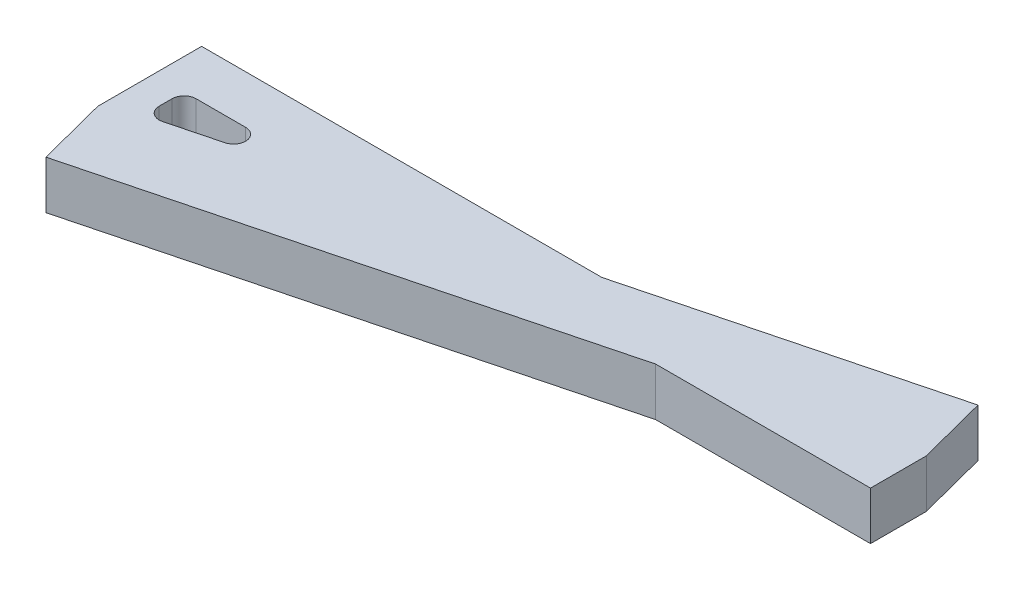
ISO-10303-21;
HEADER;
FILE_DESCRIPTION(('STEP AP214'),'2;1');
FILE_NAME('part.step','',(''),(''),'','','');
FILE_SCHEMA(('AUTOMOTIVE_DESIGN { 1 0 10303 214 1 1 1 1 }'));
ENDSEC;
DATA;
#1=APPLICATION_CONTEXT('core data for automotive mechanical design processes');
#2=APPLICATION_PROTOCOL_DEFINITION('international standard','automotive_design',2000,#1);
#3=PRODUCT_CONTEXT('',#1,'mechanical');
#4=PRODUCT('Part','Part','',(#3));
#5=PRODUCT_RELATED_PRODUCT_CATEGORY('part','',(#4));
#6=PRODUCT_DEFINITION_FORMATION('','',#4);
#7=PRODUCT_DEFINITION_CONTEXT('part definition',#1,'design');
#8=PRODUCT_DEFINITION('design','',#6,#7);
#9=PRODUCT_DEFINITION_SHAPE('','',#8);
#10=(LENGTH_UNIT() NAMED_UNIT(*) SI_UNIT(.MILLI.,.METRE.));
#11=(NAMED_UNIT(*) PLANE_ANGLE_UNIT() SI_UNIT($,.RADIAN.));
#12=(NAMED_UNIT(*) SI_UNIT($,.STERADIAN.) SOLID_ANGLE_UNIT());
#13=UNCERTAINTY_MEASURE_WITH_UNIT(LENGTH_MEASURE(1.E-05),#10,'distance_accuracy_value','');
#14=(GEOMETRIC_REPRESENTATION_CONTEXT(3) GLOBAL_UNCERTAINTY_ASSIGNED_CONTEXT((#13)) GLOBAL_UNIT_ASSIGNED_CONTEXT((#10,
#11,#12)) REPRESENTATION_CONTEXT('',''));
#15=CARTESIAN_POINT('',(0.,0.,0.));
#16=DIRECTION('',(0.,0.,1.));
#17=DIRECTION('',(1.,0.,0.));
#18=AXIS2_PLACEMENT_3D('',#15,#16,#17);
#19=CARTESIAN_POINT('',(0.,2.,0.));
#20=DIRECTION('',(0.,1.,0.));
#21=DIRECTION('',(0.,0.,1.));
#22=AXIS2_PLACEMENT_3D('',#19,#20,#21);
#23=PLANE('',#22);
#24=DIRECTION('',(0.251224776808077,0.,0.967928773989973));
#25=VECTOR('',#24,1.);
#26=CARTESIAN_POINT('',(-0.753674330424227,2.,-2.90378632196991));
#27=LINE('',#26,#25);
#28=CARTESIAN_POINT('',(-0.753674330424227,2.,-2.90378632196991));
#29=VERTEX_POINT('',#28);
#30=CARTESIAN_POINT('',(0.,2.,0.));
#31=VERTEX_POINT('',#30);
#32=EDGE_CURVE('E185',#29,#31,#27,.T.);
#33=ORIENTED_EDGE('',*,*,#32,.T.);
#34=DIRECTION('',(0.967928773989973,0.,-0.251224776808076));
#35=VECTOR('',#34,1.);
#36=CARTESIAN_POINT('',(0.,2.,0.));
#37=LINE('',#36,#35);
#38=CARTESIAN_POINT('',(20.112843106685,2.,-5.22026481310611));
#39=VERTEX_POINT('',#38);
#40=EDGE_CURVE('E188',#31,#39,#37,.T.);
#41=ORIENTED_EDGE('',*,*,#40,.T.);
#42=DIRECTION('',(1.,0.,0.));
#43=VECTOR('',#42,1.);
#44=CARTESIAN_POINT('',(20.112843106685,2.,-5.22026481310611));
#45=LINE('',#44,#43);
#46=CARTESIAN_POINT('',(29.0378632196992,2.,-5.2202648131061));
#47=VERTEX_POINT('',#46);
#48=EDGE_CURVE('E191',#39,#47,#45,.T.);
#49=ORIENTED_EDGE('',*,*,#48,.T.);
#50=DIRECTION('',(0.,0.,-1.));
#51=VECTOR('',#50,1.);
#52=CARTESIAN_POINT('',(29.0378632196992,2.,-7.2202648131061));
#53=LINE('',#52,#51);
#54=CARTESIAN_POINT('',(29.0378632196992,2.,-7.53674330424228));
#55=VERTEX_POINT('',#54);
#56=EDGE_CURVE('E193',#47,#55,#53,.T.);
#57=ORIENTED_EDGE('',*,*,#56,.T.);
#58=DIRECTION('',(-0.251224776808075,0.,-0.967928773989973));
#59=VECTOR('',#58,1.);
#60=CARTESIAN_POINT('',(29.0378632196992,2.,-7.53674330424228));
#61=LINE('',#60,#59);
#62=CARTESIAN_POINT('',(28.284188889275,2.,-10.4405296262122));
#63=VERTEX_POINT('',#62);
#64=EDGE_CURVE('E195',#55,#63,#61,.T.);
#65=ORIENTED_EDGE('',*,*,#64,.T.);
#66=DIRECTION('',(-0.967928773989973,0.,0.251224776808076));
#67=VECTOR('',#66,1.);
#68=CARTESIAN_POINT('',(28.284188889275,2.,-10.4405296262122));
#69=LINE('',#68,#67);
#70=CARTESIAN_POINT('',(15.8770250256005,2.,-7.2202648131061));
#71=VERTEX_POINT('',#70);
#72=EDGE_CURVE('E197',#63,#71,#69,.T.);
#73=ORIENTED_EDGE('',*,*,#72,.T.);
#74=DIRECTION('',(-1.,0.,0.));
#75=VECTOR('',#74,1.);
#76=CARTESIAN_POINT('',(-0.753674330424227,2.,-7.2202648131061));
#77=LINE('',#76,#75);
#78=CARTESIAN_POINT('',(-0.753674330424227,2.,-7.2202648131061));
#79=VERTEX_POINT('',#78);
#80=EDGE_CURVE('E199',#71,#79,#77,.T.);
#81=ORIENTED_EDGE('',*,*,#80,.T.);
#82=DIRECTION('',(0.,0.,1.));
#83=VECTOR('',#82,1.);
#84=CARTESIAN_POINT('',(-0.753674330424227,2.,-5.2202648131061));
#85=LINE('',#84,#83);
#86=EDGE_CURVE('E201',#79,#29,#85,.T.);
#87=ORIENTED_EDGE('',*,*,#86,.T.);
#88=EDGE_LOOP('',(#33,#41,#49,#57,#65,#73,#81,#87));
#89=FACE_BOUND('',#88,.T.);
#90=DIRECTION('',(-1.,0.,0.));
#91=VECTOR('',#90,1.);
#92=CARTESIAN_POINT('',(3.07440289689229,2.,-5.2202648131061));
#93=LINE('',#92,#91);
#94=CARTESIAN_POINT('',(3.07440289689229,2.,-5.2202648131061));
#95=VERTEX_POINT('',#94);
#96=CARTESIAN_POINT('',(1.01692955912154,2.,-5.2202648131061));
#97=VERTEX_POINT('',#96);
#98=EDGE_CURVE('E142',#95,#97,#93,.T.);
#99=ORIENTED_EDGE('',*,*,#98,.F.);
#100=CARTESIAN_POINT('',(3.0744028968924,2.,-4.7202648131061));
#101=DIRECTION('',(0.,1.,0.));
#102=DIRECTION('',(0.,0.,1.));
#103=AXIS2_PLACEMENT_3D('',#100,#101,#102);
#104=CIRCLE('',#103,0.5);
#105=CARTESIAN_POINT('',(3.20001528529633,2.,-4.23630042611108));
#106=VERTEX_POINT('',#105);
#107=EDGE_CURVE('E134',#106,#95,#104,.T.);
#108=ORIENTED_EDGE('',*,*,#107,.F.);
#109=DIRECTION('',(0.967928773989973,0.,-0.251224776808076));
#110=VECTOR('',#109,1.);
#111=CARTESIAN_POINT('',(1.14254194752558,2.,-3.70228563704833));
#112=LINE('',#111,#110);
#113=CARTESIAN_POINT('',(1.14254194752558,2.,-3.70228563704833));
#114=VERTEX_POINT('',#113);
#115=EDGE_CURVE('E163',#114,#106,#112,.T.);
#116=ORIENTED_EDGE('',*,*,#115,.F.);
#117=CARTESIAN_POINT('',(1.01692955912153,2.,-4.18625002404331));
#118=DIRECTION('',(0.,1.,0.));
#119=DIRECTION('',(0.,0.,-1.));
#120=AXIS2_PLACEMENT_3D('',#117,#118,#119);
#121=CIRCLE('',#120,0.5);
#122=CARTESIAN_POINT('',(0.516929559121535,2.,-4.18625002404332));
#123=VERTEX_POINT('',#122);
#124=EDGE_CURVE('E161',#123,#114,#121,.T.);
#125=ORIENTED_EDGE('',*,*,#124,.F.);
#126=DIRECTION('',(0.,0.,1.));
#127=VECTOR('',#126,1.);
#128=CARTESIAN_POINT('',(0.516929559121535,2.,-4.72026481310609));
#129=LINE('',#128,#127);
#130=CARTESIAN_POINT('',(0.516929559121535,2.,-4.72026481310609));
#131=VERTEX_POINT('',#130);
#132=EDGE_CURVE('E157',#131,#123,#129,.T.);
#133=ORIENTED_EDGE('',*,*,#132,.F.);
#134=CARTESIAN_POINT('',(1.01692955912153,2.,-4.7202648131061));
#135=DIRECTION('',(0.,1.,0.));
#136=DIRECTION('',(0.,0.,1.));
#137=AXIS2_PLACEMENT_3D('',#134,#135,#136);
#138=CIRCLE('',#137,0.5);
#139=EDGE_CURVE('E155',#97,#131,#138,.T.);
#140=ORIENTED_EDGE('',*,*,#139,.F.);
#141=EDGE_LOOP('',(#99,#108,#116,#125,#133,#140));
#142=FACE_BOUND('',#141,.T.);
#143=ADVANCED_FACE('F33',(#89,#142),#23,.T.);
#144=CARTESIAN_POINT('',(0.,0.,0.));
#145=DIRECTION('',(0.,1.,0.));
#146=DIRECTION('',(0.,0.,1.));
#147=AXIS2_PLACEMENT_3D('',#144,#145,#146);
#148=PLANE('',#147);
#149=DIRECTION('',(0.251224776808077,0.,0.967928773989973));
#150=VECTOR('',#149,1.);
#151=CARTESIAN_POINT('',(-0.753674330424227,0.,-2.90378632196991));
#152=LINE('',#151,#150);
#153=CARTESIAN_POINT('',(-0.753674330424227,0.,-2.90378632196991));
#154=VERTEX_POINT('',#153);
#155=CARTESIAN_POINT('',(0.,0.,0.));
#156=VERTEX_POINT('',#155);
#157=EDGE_CURVE('E150',#154,#156,#152,.T.);
#158=ORIENTED_EDGE('',*,*,#157,.F.);
#159=DIRECTION('',(0.,0.,1.));
#160=VECTOR('',#159,1.);
#161=CARTESIAN_POINT('',(-0.753674330424227,0.,-5.2202648131061));
#162=LINE('',#161,#160);
#163=CARTESIAN_POINT('',(-0.753674330424227,0.,-7.2202648131061));
#164=VERTEX_POINT('',#163);
#165=EDGE_CURVE('E189',#164,#154,#162,.T.);
#166=ORIENTED_EDGE('',*,*,#165,.F.);
#167=DIRECTION('',(-1.,0.,0.));
#168=VECTOR('',#167,1.);
#169=CARTESIAN_POINT('',(-0.753674330424227,0.,-7.2202648131061));
#170=LINE('',#169,#168);
#171=CARTESIAN_POINT('',(15.8770250256005,0.,-7.2202648131061));
#172=VERTEX_POINT('',#171);
#173=EDGE_CURVE('E217',#172,#164,#170,.T.);
#174=ORIENTED_EDGE('',*,*,#173,.F.);
#175=DIRECTION('',(-0.967928773989973,0.,0.251224776808076));
#176=VECTOR('',#175,1.);
#177=CARTESIAN_POINT('',(28.284188889275,0.,-10.4405296262122));
#178=LINE('',#177,#176);
#179=CARTESIAN_POINT('',(28.284188889275,0.,-10.4405296262122));
#180=VERTEX_POINT('',#179);
#181=EDGE_CURVE('E215',#180,#172,#178,.T.);
#182=ORIENTED_EDGE('',*,*,#181,.F.);
#183=DIRECTION('',(-0.251224776808075,0.,-0.967928773989973));
#184=VECTOR('',#183,1.);
#185=CARTESIAN_POINT('',(29.0378632196992,0.,-7.53674330424228));
#186=LINE('',#185,#184);
#187=CARTESIAN_POINT('',(29.0378632196992,0.,-7.53674330424228));
#188=VERTEX_POINT('',#187);
#189=EDGE_CURVE('E213',#188,#180,#186,.T.);
#190=ORIENTED_EDGE('',*,*,#189,.F.);
#191=DIRECTION('',(0.,0.,-1.));
#192=VECTOR('',#191,1.);
#193=CARTESIAN_POINT('',(29.0378632196992,0.,-7.2202648131061));
#194=LINE('',#193,#192);
#195=CARTESIAN_POINT('',(29.0378632196992,0.,-5.2202648131061));
#196=VERTEX_POINT('',#195);
#197=EDGE_CURVE('E211',#196,#188,#194,.T.);
#198=ORIENTED_EDGE('',*,*,#197,.F.);
#199=DIRECTION('',(1.,0.,0.));
#200=VECTOR('',#199,1.);
#201=CARTESIAN_POINT('',(20.112843106685,0.,-5.22026481310611));
#202=LINE('',#201,#200);
#203=CARTESIAN_POINT('',(20.112843106685,0.,-5.22026481310611));
#204=VERTEX_POINT('',#203);
#205=EDGE_CURVE('E208',#204,#196,#202,.T.);
#206=ORIENTED_EDGE('',*,*,#205,.F.);
#207=DIRECTION('',(0.967928773989973,0.,-0.251224776808076));
#208=VECTOR('',#207,1.);
#209=CARTESIAN_POINT('',(0.,0.,0.));
#210=LINE('',#209,#208);
#211=EDGE_CURVE('E206',#156,#204,#210,.T.);
#212=ORIENTED_EDGE('',*,*,#211,.F.);
#213=EDGE_LOOP('',(#158,#166,#174,#182,#190,#198,#206,#212));
#214=FACE_BOUND('',#213,.T.);
#215=CARTESIAN_POINT('',(3.0744028968924,0.,-4.7202648131061));
#216=DIRECTION('',(0.,1.,0.));
#217=DIRECTION('',(0.,0.,1.));
#218=AXIS2_PLACEMENT_3D('',#215,#216,#217);
#219=CIRCLE('',#218,0.5);
#220=CARTESIAN_POINT('',(3.20001528529633,0.,-4.23630042611108));
#221=VERTEX_POINT('',#220);
#222=CARTESIAN_POINT('',(3.07440289689229,0.,-5.2202648131061));
#223=VERTEX_POINT('',#222);
#224=EDGE_CURVE('E56',#221,#223,#219,.T.);
#225=ORIENTED_EDGE('',*,*,#224,.T.);
#226=DIRECTION('',(-1.,0.,0.));
#227=VECTOR('',#226,1.);
#228=CARTESIAN_POINT('',(3.07440289689229,0.,-5.2202648131061));
#229=LINE('',#228,#227);
#230=CARTESIAN_POINT('',(1.01692955912154,0.,-5.2202648131061));
#231=VERTEX_POINT('',#230);
#232=EDGE_CURVE('E149',#223,#231,#229,.T.);
#233=ORIENTED_EDGE('',*,*,#232,.T.);
#234=CARTESIAN_POINT('',(1.01692955912153,0.,-4.7202648131061));
#235=DIRECTION('',(0.,1.,0.));
#236=DIRECTION('',(0.,0.,1.));
#237=AXIS2_PLACEMENT_3D('',#234,#235,#236);
#238=CIRCLE('',#237,0.5);
#239=CARTESIAN_POINT('',(0.516929559121535,0.,-4.72026481310609));
#240=VERTEX_POINT('',#239);
#241=EDGE_CURVE('E167',#231,#240,#238,.T.);
#242=ORIENTED_EDGE('',*,*,#241,.T.);
#243=DIRECTION('',(0.,0.,1.));
#244=VECTOR('',#243,1.);
#245=CARTESIAN_POINT('',(0.516929559121535,0.,-4.72026481310609));
#246=LINE('',#245,#244);
#247=CARTESIAN_POINT('',(0.516929559121535,0.,-4.18625002404332));
#248=VERTEX_POINT('',#247);
#249=EDGE_CURVE('E170',#240,#248,#246,.T.);
#250=ORIENTED_EDGE('',*,*,#249,.T.);
#251=CARTESIAN_POINT('',(1.01692955912153,0.,-4.18625002404331));
#252=DIRECTION('',(0.,1.,0.));
#253=DIRECTION('',(0.,0.,-1.));
#254=AXIS2_PLACEMENT_3D('',#251,#252,#253);
#255=CIRCLE('',#254,0.5);
#256=CARTESIAN_POINT('',(1.14254194752558,0.,-3.70228563704833));
#257=VERTEX_POINT('',#256);
#258=EDGE_CURVE('E173',#248,#257,#255,.T.);
#259=ORIENTED_EDGE('',*,*,#258,.T.);
#260=DIRECTION('',(0.967928773989973,0.,-0.251224776808076));
#261=VECTOR('',#260,1.);
#262=CARTESIAN_POINT('',(1.14254194752558,0.,-3.70228563704833));
#263=LINE('',#262,#261);
#264=EDGE_CURVE('E143',#257,#221,#263,.T.);
#265=ORIENTED_EDGE('',*,*,#264,.T.);
#266=EDGE_LOOP('',(#225,#233,#242,#250,#259,#265));
#267=FACE_BOUND('',#266,.T.);
#268=ADVANCED_FACE('F247',(#214,#267),#148,.F.);
#269=CARTESIAN_POINT('',(-0.753674330424227,2.,-2.90378632196991));
#270=DIRECTION('',(0.967928773989973,0.,-0.251224776808077));
#271=DIRECTION('',(-0.251224776808076,0.,-0.967928773989973));
#272=AXIS2_PLACEMENT_3D('',#269,#270,#271);
#273=PLANE('',#272);
#274=ORIENTED_EDGE('',*,*,#157,.T.);
#275=DIRECTION('',(0.,-1.,0.));
#276=VECTOR('',#275,1.);
#277=CARTESIAN_POINT('',(0.,2.,0.));
#278=LINE('',#277,#276);
#279=EDGE_CURVE('E11',#31,#156,#278,.T.);
#280=ORIENTED_EDGE('',*,*,#279,.F.);
#281=ORIENTED_EDGE('',*,*,#32,.F.);
#282=DIRECTION('',(0.,-1.,0.));
#283=VECTOR('',#282,1.);
#284=CARTESIAN_POINT('',(-0.753674330424227,2.,-2.90378632196991));
#285=LINE('',#284,#283);
#286=EDGE_CURVE('E203',#29,#154,#285,.T.);
#287=ORIENTED_EDGE('',*,*,#286,.T.);
#288=EDGE_LOOP('',(#274,#280,#281,#287));
#289=FACE_BOUND('',#288,.T.);
#290=ADVANCED_FACE('F35',(#289),#273,.F.);
#291=CARTESIAN_POINT('',(0.,2.,0.));
#292=DIRECTION('',(-0.251224776808076,0.,-0.967928773989973));
#293=DIRECTION('',(-0.967928773989973,0.,0.251224776808076));
#294=AXIS2_PLACEMENT_3D('',#291,#292,#293);
#295=PLANE('',#294);
#296=ORIENTED_EDGE('',*,*,#211,.T.);
#297=DIRECTION('',(0.,-1.,0.));
#298=VECTOR('',#297,1.);
#299=CARTESIAN_POINT('',(20.112843106685,2.,-5.22026481310611));
#300=LINE('',#299,#298);
#301=EDGE_CURVE('E41',#39,#204,#300,.T.);
#302=ORIENTED_EDGE('',*,*,#301,.F.);
#303=ORIENTED_EDGE('',*,*,#40,.F.);
#304=ORIENTED_EDGE('',*,*,#279,.T.);
#305=EDGE_LOOP('',(#296,#302,#303,#304));
#306=FACE_BOUND('',#305,.T.);
#307=ADVANCED_FACE('F264',(#306),#295,.F.);
#308=CARTESIAN_POINT('',(20.112843106685,2.,-5.22026481310611));
#309=DIRECTION('',(0.,0.,-1.));
#310=DIRECTION('',(-1.,0.,0.));
#311=AXIS2_PLACEMENT_3D('',#308,#309,#310);
#312=PLANE('',#311);
#313=ORIENTED_EDGE('',*,*,#205,.T.);
#314=DIRECTION('',(0.,-1.,0.));
#315=VECTOR('',#314,1.);
#316=CARTESIAN_POINT('',(29.0378632196992,2.,-5.2202648131061));
#317=LINE('',#316,#315);
#318=EDGE_CURVE('E235',#47,#196,#317,.T.);
#319=ORIENTED_EDGE('',*,*,#318,.F.);
#320=ORIENTED_EDGE('',*,*,#48,.F.);
#321=ORIENTED_EDGE('',*,*,#301,.T.);
#322=EDGE_LOOP('',(#313,#319,#320,#321));
#323=FACE_BOUND('',#322,.T.);
#324=ADVANCED_FACE('F242',(#323),#312,.F.);
#325=CARTESIAN_POINT('',(29.0378632196992,2.,-7.2202648131061));
#326=DIRECTION('',(-1.,0.,0.));
#327=DIRECTION('',(0.,0.,1.));
#328=AXIS2_PLACEMENT_3D('',#325,#326,#327);
#329=PLANE('',#328);
#330=ORIENTED_EDGE('',*,*,#197,.T.);
#331=DIRECTION('',(0.,-1.,0.));
#332=VECTOR('',#331,1.);
#333=CARTESIAN_POINT('',(29.0378632196992,2.,-7.53674330424228));
#334=LINE('',#333,#332);
#335=EDGE_CURVE('E232',#55,#188,#334,.T.);
#336=ORIENTED_EDGE('',*,*,#335,.F.);
#337=ORIENTED_EDGE('',*,*,#56,.F.);
#338=ORIENTED_EDGE('',*,*,#318,.T.);
#339=EDGE_LOOP('',(#330,#336,#337,#338));
#340=FACE_BOUND('',#339,.T.);
#341=ADVANCED_FACE('F253',(#340),#329,.F.);
#342=CARTESIAN_POINT('',(29.0378632196992,2.,-7.53674330424228));
#343=DIRECTION('',(-0.967928773989973,0.,0.251224776808075));
#344=DIRECTION('',(0.251224776808075,0.,0.967928773989973));
#345=AXIS2_PLACEMENT_3D('',#342,#343,#344);
#346=PLANE('',#345);
#347=ORIENTED_EDGE('',*,*,#189,.T.);
#348=DIRECTION('',(0.,-1.,0.));
#349=VECTOR('',#348,1.);
#350=CARTESIAN_POINT('',(28.284188889275,2.,-10.4405296262122));
#351=LINE('',#350,#349);
#352=EDGE_CURVE('E229',#63,#180,#351,.T.);
#353=ORIENTED_EDGE('',*,*,#352,.F.);
#354=ORIENTED_EDGE('',*,*,#64,.F.);
#355=ORIENTED_EDGE('',*,*,#335,.T.);
#356=EDGE_LOOP('',(#347,#353,#354,#355));
#357=FACE_BOUND('',#356,.T.);
#358=ADVANCED_FACE('F257',(#357),#346,.F.);
#359=CARTESIAN_POINT('',(28.284188889275,2.,-10.4405296262122));
#360=DIRECTION('',(0.251224776808076,0.,0.967928773989973));
#361=DIRECTION('',(0.967928773989973,0.,-0.251224776808076));
#362=AXIS2_PLACEMENT_3D('',#359,#360,#361);
#363=PLANE('',#362);
#364=ORIENTED_EDGE('',*,*,#181,.T.);
#365=DIRECTION('',(0.,-1.,0.));
#366=VECTOR('',#365,1.);
#367=CARTESIAN_POINT('',(15.8770250256005,2.,-7.2202648131061));
#368=LINE('',#367,#366);
#369=EDGE_CURVE('E226',#71,#172,#368,.T.);
#370=ORIENTED_EDGE('',*,*,#369,.F.);
#371=ORIENTED_EDGE('',*,*,#72,.F.);
#372=ORIENTED_EDGE('',*,*,#352,.T.);
#373=EDGE_LOOP('',(#364,#370,#371,#372));
#374=FACE_BOUND('',#373,.T.);
#375=ADVANCED_FACE('F282',(#374),#363,.F.);
#376=CARTESIAN_POINT('',(-0.753674330424227,2.,-7.2202648131061));
#377=DIRECTION('',(0.,0.,1.));
#378=DIRECTION('',(1.,0.,0.));
#379=AXIS2_PLACEMENT_3D('',#376,#377,#378);
#380=PLANE('',#379);
#381=ORIENTED_EDGE('',*,*,#173,.T.);
#382=DIRECTION('',(0.,-1.,0.));
#383=VECTOR('',#382,1.);
#384=CARTESIAN_POINT('',(-0.753674330424227,2.,-7.2202648131061));
#385=LINE('',#384,#383);
#386=EDGE_CURVE('E223',#79,#164,#385,.T.);
#387=ORIENTED_EDGE('',*,*,#386,.F.);
#388=ORIENTED_EDGE('',*,*,#80,.F.);
#389=ORIENTED_EDGE('',*,*,#369,.T.);
#390=EDGE_LOOP('',(#381,#387,#388,#389));
#391=FACE_BOUND('',#390,.T.);
#392=ADVANCED_FACE('F271',(#391),#380,.F.);
#393=CARTESIAN_POINT('',(-0.753674330424227,2.,-5.2202648131061));
#394=DIRECTION('',(1.,0.,0.));
#395=DIRECTION('',(0.,0.,-1.));
#396=AXIS2_PLACEMENT_3D('',#393,#394,#395);
#397=PLANE('',#396);
#398=ORIENTED_EDGE('',*,*,#165,.T.);
#399=ORIENTED_EDGE('',*,*,#286,.F.);
#400=ORIENTED_EDGE('',*,*,#86,.F.);
#401=ORIENTED_EDGE('',*,*,#386,.T.);
#402=EDGE_LOOP('',(#398,#399,#400,#401));
#403=FACE_BOUND('',#402,.T.);
#404=ADVANCED_FACE('F274',(#403),#397,.F.);
#405=CARTESIAN_POINT('',(3.0744028968924,2.,-4.7202648131061));
#406=DIRECTION('',(0.,-1.,0.));
#407=DIRECTION('',(0.,0.,-1.));
#408=AXIS2_PLACEMENT_3D('',#405,#406,#407);
#409=CYLINDRICAL_SURFACE('',#408,0.5);
#410=ORIENTED_EDGE('',*,*,#224,.F.);
#411=DIRECTION('',(0.,-1.,0.));
#412=VECTOR('',#411,1.);
#413=CARTESIAN_POINT('',(3.20001528529633,2.,-4.23630042611108));
#414=LINE('',#413,#412);
#415=EDGE_CURVE('E138',#106,#221,#414,.T.);
#416=ORIENTED_EDGE('',*,*,#415,.F.);
#417=ORIENTED_EDGE('',*,*,#107,.T.);
#418=DIRECTION('',(0.,-1.,0.));
#419=VECTOR('',#418,1.);
#420=CARTESIAN_POINT('',(3.07440289689229,2.,-5.2202648131061));
#421=LINE('',#420,#419);
#422=EDGE_CURVE('E137',#95,#223,#421,.T.);
#423=ORIENTED_EDGE('',*,*,#422,.T.);
#424=EDGE_LOOP('',(#410,#416,#417,#423));
#425=FACE_BOUND('',#424,.T.);
#426=ADVANCED_FACE('F136',(#425),#409,.F.);
#427=CARTESIAN_POINT('',(3.07440289689229,2.,-5.2202648131061));
#428=DIRECTION('',(0.,0.,1.));
#429=DIRECTION('',(1.,0.,0.));
#430=AXIS2_PLACEMENT_3D('',#427,#428,#429);
#431=PLANE('',#430);
#432=ORIENTED_EDGE('',*,*,#232,.F.);
#433=ORIENTED_EDGE('',*,*,#422,.F.);
#434=ORIENTED_EDGE('',*,*,#98,.T.);
#435=DIRECTION('',(0.,-1.,0.));
#436=VECTOR('',#435,1.);
#437=CARTESIAN_POINT('',(1.01692955912154,2.,-5.2202648131061));
#438=LINE('',#437,#436);
#439=EDGE_CURVE('E151',#97,#231,#438,.T.);
#440=ORIENTED_EDGE('',*,*,#439,.T.);
#441=EDGE_LOOP('',(#432,#433,#434,#440));
#442=FACE_BOUND('',#441,.T.);
#443=ADVANCED_FACE('F146',(#442),#431,.T.);
#444=CARTESIAN_POINT('',(1.01692955912153,2.,-4.7202648131061));
#445=DIRECTION('',(0.,-1.,0.));
#446=DIRECTION('',(0.,0.,-1.));
#447=AXIS2_PLACEMENT_3D('',#444,#445,#446);
#448=CYLINDRICAL_SURFACE('',#447,0.5);
#449=ORIENTED_EDGE('',*,*,#241,.F.);
#450=ORIENTED_EDGE('',*,*,#439,.F.);
#451=ORIENTED_EDGE('',*,*,#139,.T.);
#452=DIRECTION('',(0.,-1.,0.));
#453=VECTOR('',#452,1.);
#454=CARTESIAN_POINT('',(0.516929559121535,2.,-4.72026481310609));
#455=LINE('',#454,#453);
#456=EDGE_CURVE('E182',#131,#240,#455,.T.);
#457=ORIENTED_EDGE('',*,*,#456,.T.);
#458=EDGE_LOOP('',(#449,#450,#451,#457));
#459=FACE_BOUND('',#458,.T.);
#460=ADVANCED_FACE('F293',(#459),#448,.F.);
#461=CARTESIAN_POINT('',(0.516929559121535,2.,-4.72026481310609));
#462=DIRECTION('',(1.,0.,0.));
#463=DIRECTION('',(0.,0.,-1.));
#464=AXIS2_PLACEMENT_3D('',#461,#462,#463);
#465=PLANE('',#464);
#466=ORIENTED_EDGE('',*,*,#249,.F.);
#467=ORIENTED_EDGE('',*,*,#456,.F.);
#468=ORIENTED_EDGE('',*,*,#132,.T.);
#469=DIRECTION('',(0.,-1.,0.));
#470=VECTOR('',#469,1.);
#471=CARTESIAN_POINT('',(0.516929559121535,2.,-4.18625002404332));
#472=LINE('',#471,#470);
#473=EDGE_CURVE('E180',#123,#248,#472,.T.);
#474=ORIENTED_EDGE('',*,*,#473,.T.);
#475=EDGE_LOOP('',(#466,#467,#468,#474));
#476=FACE_BOUND('',#475,.T.);
#477=ADVANCED_FACE('F296',(#476),#465,.T.);
#478=CARTESIAN_POINT('',(1.01692955912153,2.,-4.18625002404331));
#479=DIRECTION('',(0.,-1.,0.));
#480=DIRECTION('',(0.,0.,-1.));
#481=AXIS2_PLACEMENT_3D('',#478,#479,#480);
#482=CYLINDRICAL_SURFACE('',#481,0.5);
#483=ORIENTED_EDGE('',*,*,#258,.F.);
#484=ORIENTED_EDGE('',*,*,#473,.F.);
#485=ORIENTED_EDGE('',*,*,#124,.T.);
#486=DIRECTION('',(0.,-1.,0.));
#487=VECTOR('',#486,1.);
#488=CARTESIAN_POINT('',(1.14254194752558,2.,-3.70228563704833));
#489=LINE('',#488,#487);
#490=EDGE_CURVE('E48',#114,#257,#489,.T.);
#491=ORIENTED_EDGE('',*,*,#490,.T.);
#492=EDGE_LOOP('',(#483,#484,#485,#491));
#493=FACE_BOUND('',#492,.T.);
#494=ADVANCED_FACE('F300',(#493),#482,.F.);
#495=CARTESIAN_POINT('',(1.14254194752558,2.,-3.70228563704833));
#496=DIRECTION('',(-0.251224776808076,0.,-0.967928773989973));
#497=DIRECTION('',(-0.967928773989973,0.,0.251224776808076));
#498=AXIS2_PLACEMENT_3D('',#495,#496,#497);
#499=PLANE('',#498);
#500=ORIENTED_EDGE('',*,*,#264,.F.);
#501=ORIENTED_EDGE('',*,*,#490,.F.);
#502=ORIENTED_EDGE('',*,*,#115,.T.);
#503=ORIENTED_EDGE('',*,*,#415,.T.);
#504=EDGE_LOOP('',(#500,#501,#502,#503));
#505=FACE_BOUND('',#504,.T.);
#506=ADVANCED_FACE('F304',(#505),#499,.T.);
#507=CLOSED_SHELL('',(#143,#268,#290,#307,#324,#341,#358,#375,#392,#404,#426,#443,#460,#477,
#494,#506));
#508=MANIFOLD_SOLID_BREP('B2',#507);
#509=ADVANCED_BREP_SHAPE_REPRESENTATION('',(#18,#508),#14);
#510=SHAPE_DEFINITION_REPRESENTATION(#9,#509);
ENDSEC;
END-ISO-10303-21;
